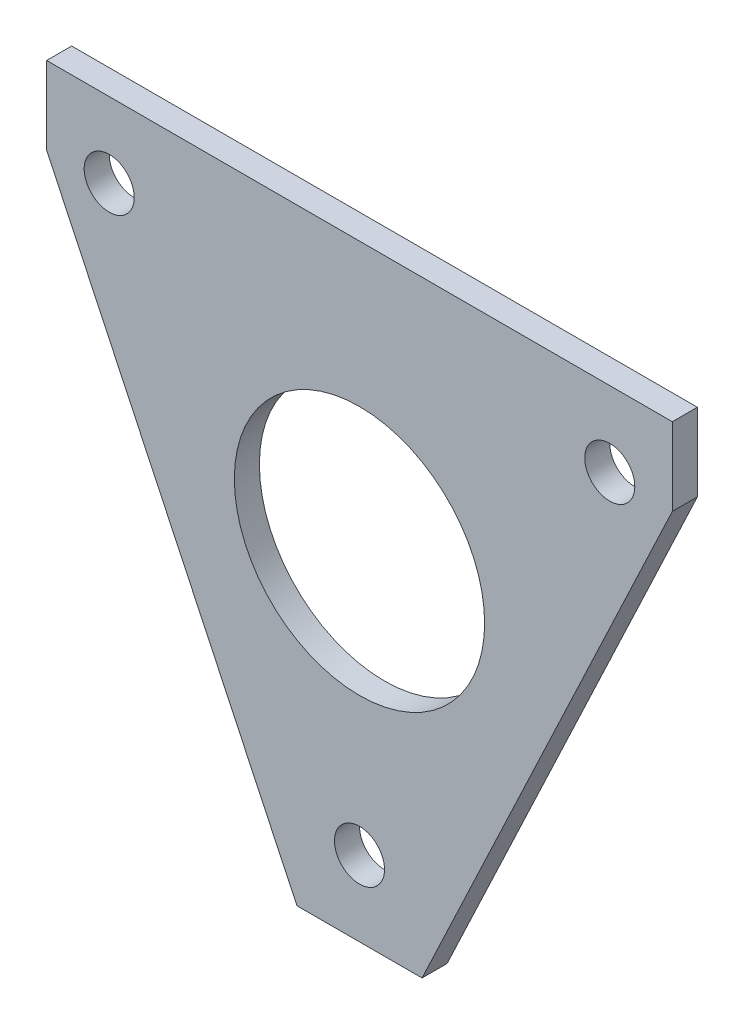
ISO-10303-21;
HEADER;
FILE_DESCRIPTION(('STEP AP214'),'2;1');
FILE_NAME('part.step','',(''),(''),'','','');
FILE_SCHEMA(('AUTOMOTIVE_DESIGN { 1 0 10303 214 1 1 1 1 }'));
ENDSEC;
DATA;
#1=APPLICATION_CONTEXT('core data for automotive mechanical design processes');
#2=APPLICATION_PROTOCOL_DEFINITION('international standard','automotive_design',2000,#1);
#3=PRODUCT_CONTEXT('',#1,'mechanical');
#4=PRODUCT('Part','Part','',(#3));
#5=PRODUCT_RELATED_PRODUCT_CATEGORY('part','',(#4));
#6=PRODUCT_DEFINITION_FORMATION('','',#4);
#7=PRODUCT_DEFINITION_CONTEXT('part definition',#1,'design');
#8=PRODUCT_DEFINITION('design','',#6,#7);
#9=PRODUCT_DEFINITION_SHAPE('','',#8);
#10=(LENGTH_UNIT() NAMED_UNIT(*) SI_UNIT(.MILLI.,.METRE.));
#11=(NAMED_UNIT(*) PLANE_ANGLE_UNIT() SI_UNIT($,.RADIAN.));
#12=(NAMED_UNIT(*) SI_UNIT($,.STERADIAN.) SOLID_ANGLE_UNIT());
#13=UNCERTAINTY_MEASURE_WITH_UNIT(LENGTH_MEASURE(1.E-05),#10,'distance_accuracy_value','');
#14=(GEOMETRIC_REPRESENTATION_CONTEXT(3) GLOBAL_UNCERTAINTY_ASSIGNED_CONTEXT((#13)) GLOBAL_UNIT_ASSIGNED_CONTEXT((#10,
#11,#12)) REPRESENTATION_CONTEXT('',''));
#15=CARTESIAN_POINT('',(0.,0.,0.));
#16=DIRECTION('',(0.,0.,1.));
#17=DIRECTION('',(1.,0.,0.));
#18=AXIS2_PLACEMENT_3D('',#15,#16,#17);
#19=CARTESIAN_POINT('',(0.,0.,4.));
#20=DIRECTION('',(0.,0.,1.));
#21=DIRECTION('',(1.,0.,0.));
#22=AXIS2_PLACEMENT_3D('',#19,#20,#21);
#23=PLANE('',#22);
#24=CARTESIAN_POINT('',(-21.4250045027839,-25.2125341603179,4.));
#25=DIRECTION('',(0.,0.,1.));
#26=DIRECTION('',(1.,0.,0.));
#27=AXIS2_PLACEMENT_3D('',#24,#25,#26);
#28=CIRCLE('',#27,20.);
#29=CARTESIAN_POINT('',(-1.4250045027839,-25.2125341603179,4.));
#30=VERTEX_POINT('',#29);
#31=EDGE_CURVE('E182',#30,#30,#28,.T.);
#32=ORIENTED_EDGE('',*,*,#31,.F.);
#33=EDGE_LOOP('',(#32));
#34=FACE_BOUND('',#33,.T.);
#35=CARTESIAN_POINT('',(18.5749954972161,5.68546583968215,4.));
#36=DIRECTION('',(0.,0.,1.));
#37=DIRECTION('',(1.,0.,0.));
#38=AXIS2_PLACEMENT_3D('',#35,#36,#37);
#39=CIRCLE('',#38,4.);
#40=CARTESIAN_POINT('',(22.5749954972161,5.68546583968215,4.));
#41=VERTEX_POINT('',#40);
#42=EDGE_CURVE('E194',#41,#41,#39,.T.);
#43=ORIENTED_EDGE('',*,*,#42,.F.);
#44=EDGE_LOOP('',(#43));
#45=FACE_BOUND('',#44,.T.);
#46=DIRECTION('',(0.,-1.,0.));
#47=VECTOR('',#46,1.);
#48=CARTESIAN_POINT('',(-71.4250045027839,17.6854658396821,4.));
#49=LINE('',#48,#47);
#50=CARTESIAN_POINT('',(-71.4250045027839,17.6854658396821,4.));
#51=VERTEX_POINT('',#50);
#52=CARTESIAN_POINT('',(-71.4250045027839,5.27207621951218,4.));
#53=VERTEX_POINT('',#52);
#54=EDGE_CURVE('E130',#51,#53,#49,.T.);
#55=ORIENTED_EDGE('',*,*,#54,.T.);
#56=DIRECTION('',(0.427498434771691,-0.904016088500506,0.));
#57=VECTOR('',#56,1.);
#58=CARTESIAN_POINT('',(-71.4250045027839,5.27207621951218,4.));
#59=LINE('',#58,#57);
#60=CARTESIAN_POINT('',(-31.4250045027839,-79.3145341603179,4.));
#61=VERTEX_POINT('',#60);
#62=EDGE_CURVE('E88',#53,#61,#59,.T.);
#63=ORIENTED_EDGE('',*,*,#62,.T.);
#64=DIRECTION('',(1.,0.,0.));
#65=VECTOR('',#64,1.);
#66=CARTESIAN_POINT('',(-31.4250045027839,-79.3145341603179,4.));
#67=LINE('',#66,#65);
#68=CARTESIAN_POINT('',(-11.4250045027839,-79.3145341603179,4.));
#69=VERTEX_POINT('',#68);
#70=EDGE_CURVE('E101',#61,#69,#67,.T.);
#71=ORIENTED_EDGE('',*,*,#70,.T.);
#72=DIRECTION('',(0.427498434771691,0.904016088500506,0.));
#73=VECTOR('',#72,1.);
#74=CARTESIAN_POINT('',(28.5749954972161,5.27207621951221,4.));
#75=LINE('',#74,#73);
#76=CARTESIAN_POINT('',(28.5749954972161,5.27207621951221,4.));
#77=VERTEX_POINT('',#76);
#78=EDGE_CURVE('E95',#69,#77,#75,.T.);
#79=ORIENTED_EDGE('',*,*,#78,.T.);
#80=DIRECTION('',(0.,1.,0.));
#81=VECTOR('',#80,1.);
#82=CARTESIAN_POINT('',(28.5749954972161,17.6854658396821,4.));
#83=LINE('',#82,#81);
#84=CARTESIAN_POINT('',(28.5749954972161,17.6854658396821,4.));
#85=VERTEX_POINT('',#84);
#86=EDGE_CURVE('E99',#77,#85,#83,.T.);
#87=ORIENTED_EDGE('',*,*,#86,.T.);
#88=DIRECTION('',(-1.,0.,0.));
#89=VECTOR('',#88,1.);
#90=CARTESIAN_POINT('',(-71.4250045027839,17.6854658396821,4.));
#91=LINE('',#90,#89);
#92=EDGE_CURVE('E51',#85,#51,#91,.T.);
#93=ORIENTED_EDGE('',*,*,#92,.T.);
#94=EDGE_LOOP('',(#55,#63,#71,#79,#87,#93));
#95=FACE_BOUND('',#94,.T.);
#96=CARTESIAN_POINT('',(-61.4250045027839,5.68546583968215,4.));
#97=DIRECTION('',(0.,0.,1.));
#98=DIRECTION('',(1.,0.,0.));
#99=AXIS2_PLACEMENT_3D('',#96,#97,#98);
#100=CIRCLE('',#99,4.00000000000001);
#101=CARTESIAN_POINT('',(-57.4250045027839,5.68546583968215,4.));
#102=VERTEX_POINT('',#101);
#103=EDGE_CURVE('E123',#102,#102,#100,.T.);
#104=ORIENTED_EDGE('',*,*,#103,.F.);
#105=EDGE_LOOP('',(#104));
#106=FACE_BOUND('',#105,.T.);
#107=CARTESIAN_POINT('',(-21.4250045027839,-67.3145341603179,4.));
#108=DIRECTION('',(0.,0.,1.));
#109=DIRECTION('',(1.,0.,0.));
#110=AXIS2_PLACEMENT_3D('',#107,#108,#109);
#111=CIRCLE('',#110,4.);
#112=CARTESIAN_POINT('',(-17.4250045027839,-67.3145341603179,4.));
#113=VERTEX_POINT('',#112);
#114=EDGE_CURVE('E187',#113,#113,#111,.T.);
#115=ORIENTED_EDGE('',*,*,#114,.F.);
#116=EDGE_LOOP('',(#115));
#117=FACE_BOUND('',#116,.T.);
#118=ADVANCED_FACE('F33',(#34,#45,#95,#106,#117),#23,.T.);
#119=CARTESIAN_POINT('',(0.,0.,0.));
#120=DIRECTION('',(0.,0.,1.));
#121=DIRECTION('',(1.,0.,0.));
#122=AXIS2_PLACEMENT_3D('',#119,#120,#121);
#123=PLANE('',#122);
#124=CARTESIAN_POINT('',(-21.4250045027839,-25.2125341603179,0.));
#125=DIRECTION('',(0.,0.,1.));
#126=DIRECTION('',(1.,0.,0.));
#127=AXIS2_PLACEMENT_3D('',#124,#125,#126);
#128=CIRCLE('',#127,20.);
#129=CARTESIAN_POINT('',(-1.4250045027839,-25.2125341603179,0.));
#130=VERTEX_POINT('',#129);
#131=EDGE_CURVE('E37',#130,#130,#128,.T.);
#132=ORIENTED_EDGE('',*,*,#131,.T.);
#133=EDGE_LOOP('',(#132));
#134=FACE_BOUND('',#133,.T.);
#135=CARTESIAN_POINT('',(18.5749954972161,5.68546583968215,0.));
#136=DIRECTION('',(0.,0.,1.));
#137=DIRECTION('',(1.,0.,0.));
#138=AXIS2_PLACEMENT_3D('',#135,#136,#137);
#139=CIRCLE('',#138,4.);
#140=CARTESIAN_POINT('',(22.5749954972161,5.68546583968215,0.));
#141=VERTEX_POINT('',#140);
#142=EDGE_CURVE('E192',#141,#141,#139,.T.);
#143=ORIENTED_EDGE('',*,*,#142,.T.);
#144=EDGE_LOOP('',(#143));
#145=FACE_BOUND('',#144,.T.);
#146=DIRECTION('',(0.,-1.,0.));
#147=VECTOR('',#146,1.);
#148=CARTESIAN_POINT('',(-71.4250045027839,17.6854658396821,0.));
#149=LINE('',#148,#147);
#150=CARTESIAN_POINT('',(-71.4250045027839,17.6854658396821,0.));
#151=VERTEX_POINT('',#150);
#152=CARTESIAN_POINT('',(-71.4250045027839,5.27207621951218,0.));
#153=VERTEX_POINT('',#152);
#154=EDGE_CURVE('E119',#151,#153,#149,.T.);
#155=ORIENTED_EDGE('',*,*,#154,.F.);
#156=DIRECTION('',(-1.,0.,0.));
#157=VECTOR('',#156,1.);
#158=CARTESIAN_POINT('',(-71.4250045027839,17.6854658396821,0.));
#159=LINE('',#158,#157);
#160=CARTESIAN_POINT('',(28.5749954972161,17.6854658396821,0.));
#161=VERTEX_POINT('',#160);
#162=EDGE_CURVE('E80',#161,#151,#159,.T.);
#163=ORIENTED_EDGE('',*,*,#162,.F.);
#164=DIRECTION('',(0.,1.,0.));
#165=VECTOR('',#164,1.);
#166=CARTESIAN_POINT('',(28.5749954972161,17.6854658396821,0.));
#167=LINE('',#166,#165);
#168=CARTESIAN_POINT('',(28.5749954972161,5.27207621951221,0.));
#169=VERTEX_POINT('',#168);
#170=EDGE_CURVE('E74',#169,#161,#167,.T.);
#171=ORIENTED_EDGE('',*,*,#170,.F.);
#172=DIRECTION('',(0.427498434771691,0.904016088500506,0.));
#173=VECTOR('',#172,1.);
#174=CARTESIAN_POINT('',(28.5749954972161,5.27207621951221,0.));
#175=LINE('',#174,#173);
#176=CARTESIAN_POINT('',(-11.4250045027839,-79.3145341603179,0.));
#177=VERTEX_POINT('',#176);
#178=EDGE_CURVE('E109',#177,#169,#175,.T.);
#179=ORIENTED_EDGE('',*,*,#178,.F.);
#180=DIRECTION('',(1.,0.,0.));
#181=VECTOR('',#180,1.);
#182=CARTESIAN_POINT('',(-31.4250045027839,-79.3145341603179,0.));
#183=LINE('',#182,#181);
#184=CARTESIAN_POINT('',(-31.4250045027839,-79.3145341603179,0.));
#185=VERTEX_POINT('',#184);
#186=EDGE_CURVE('E125',#185,#177,#183,.T.);
#187=ORIENTED_EDGE('',*,*,#186,.F.);
#188=DIRECTION('',(0.427498434771691,-0.904016088500506,0.));
#189=VECTOR('',#188,1.);
#190=CARTESIAN_POINT('',(-71.4250045027839,5.27207621951218,0.));
#191=LINE('',#190,#189);
#192=EDGE_CURVE('E122',#153,#185,#191,.T.);
#193=ORIENTED_EDGE('',*,*,#192,.F.);
#194=EDGE_LOOP('',(#155,#163,#171,#179,#187,#193));
#195=FACE_BOUND('',#194,.T.);
#196=CARTESIAN_POINT('',(-61.4250045027839,5.68546583968215,0.));
#197=DIRECTION('',(0.,0.,1.));
#198=DIRECTION('',(1.,0.,0.));
#199=AXIS2_PLACEMENT_3D('',#196,#197,#198);
#200=CIRCLE('',#199,4.00000000000001);
#201=CARTESIAN_POINT('',(-57.4250045027839,5.68546583968215,0.));
#202=VERTEX_POINT('',#201);
#203=EDGE_CURVE('E197',#202,#202,#200,.T.);
#204=ORIENTED_EDGE('',*,*,#203,.T.);
#205=EDGE_LOOP('',(#204));
#206=FACE_BOUND('',#205,.T.);
#207=CARTESIAN_POINT('',(-21.4250045027839,-67.3145341603179,0.));
#208=DIRECTION('',(0.,0.,1.));
#209=DIRECTION('',(1.,0.,0.));
#210=AXIS2_PLACEMENT_3D('',#207,#208,#209);
#211=CIRCLE('',#210,4.);
#212=CARTESIAN_POINT('',(-17.4250045027839,-67.3145341603179,0.));
#213=VERTEX_POINT('',#212);
#214=EDGE_CURVE('E185',#213,#213,#211,.T.);
#215=ORIENTED_EDGE('',*,*,#214,.T.);
#216=EDGE_LOOP('',(#215));
#217=FACE_BOUND('',#216,.T.);
#218=ADVANCED_FACE('F140',(#134,#145,#195,#206,#217),#123,.F.);
#219=CARTESIAN_POINT('',(-71.4250045027839,17.6854658396821,4.));
#220=DIRECTION('',(1.,0.,0.));
#221=DIRECTION('',(0.,1.,0.));
#222=AXIS2_PLACEMENT_3D('',#219,#220,#221);
#223=PLANE('',#222);
#224=ORIENTED_EDGE('',*,*,#154,.T.);
#225=DIRECTION('',(0.,0.,-1.));
#226=VECTOR('',#225,1.);
#227=CARTESIAN_POINT('',(-71.4250045027839,5.27207621951218,4.));
#228=LINE('',#227,#226);
#229=EDGE_CURVE('E11',#53,#153,#228,.T.);
#230=ORIENTED_EDGE('',*,*,#229,.F.);
#231=ORIENTED_EDGE('',*,*,#54,.F.);
#232=DIRECTION('',(0.,0.,-1.));
#233=VECTOR('',#232,1.);
#234=CARTESIAN_POINT('',(-71.4250045027839,17.6854658396821,4.));
#235=LINE('',#234,#233);
#236=EDGE_CURVE('E115',#51,#151,#235,.T.);
#237=ORIENTED_EDGE('',*,*,#236,.T.);
#238=EDGE_LOOP('',(#224,#230,#231,#237));
#239=FACE_BOUND('',#238,.T.);
#240=ADVANCED_FACE('F35',(#239),#223,.F.);
#241=CARTESIAN_POINT('',(-71.4250045027839,5.27207621951218,4.));
#242=DIRECTION('',(0.904016088500506,0.427498434771691,0.));
#243=DIRECTION('',(-0.427498434771691,0.904016088500506,0.));
#244=AXIS2_PLACEMENT_3D('',#241,#242,#243);
#245=PLANE('',#244);
#246=ORIENTED_EDGE('',*,*,#192,.T.);
#247=DIRECTION('',(0.,0.,-1.));
#248=VECTOR('',#247,1.);
#249=CARTESIAN_POINT('',(-31.4250045027839,-79.3145341603179,4.));
#250=LINE('',#249,#248);
#251=EDGE_CURVE('E43',#61,#185,#250,.T.);
#252=ORIENTED_EDGE('',*,*,#251,.F.);
#253=ORIENTED_EDGE('',*,*,#62,.F.);
#254=ORIENTED_EDGE('',*,*,#229,.T.);
#255=EDGE_LOOP('',(#246,#252,#253,#254));
#256=FACE_BOUND('',#255,.T.);
#257=ADVANCED_FACE('F257',(#256),#245,.F.);
#258=CARTESIAN_POINT('',(-31.4250045027839,-79.3145341603179,4.));
#259=DIRECTION('',(0.,1.,0.));
#260=DIRECTION('',(0.,0.,1.));
#261=AXIS2_PLACEMENT_3D('',#258,#259,#260);
#262=PLANE('',#261);
#263=ORIENTED_EDGE('',*,*,#186,.T.);
#264=DIRECTION('',(0.,0.,-1.));
#265=VECTOR('',#264,1.);
#266=CARTESIAN_POINT('',(-11.4250045027839,-79.3145341603179,4.));
#267=LINE('',#266,#265);
#268=EDGE_CURVE('E110',#69,#177,#267,.T.);
#269=ORIENTED_EDGE('',*,*,#268,.F.);
#270=ORIENTED_EDGE('',*,*,#70,.F.);
#271=ORIENTED_EDGE('',*,*,#251,.T.);
#272=EDGE_LOOP('',(#263,#269,#270,#271));
#273=FACE_BOUND('',#272,.T.);
#274=ADVANCED_FACE('F137',(#273),#262,.F.);
#275=CARTESIAN_POINT('',(28.5749954972161,5.27207621951221,4.));
#276=DIRECTION('',(-0.904016088500506,0.427498434771691,0.));
#277=DIRECTION('',(-0.427498434771691,-0.904016088500506,0.));
#278=AXIS2_PLACEMENT_3D('',#275,#276,#277);
#279=PLANE('',#278);
#280=ORIENTED_EDGE('',*,*,#178,.T.);
#281=DIRECTION('',(0.,0.,-1.));
#282=VECTOR('',#281,1.);
#283=CARTESIAN_POINT('',(28.5749954972161,5.27207621951221,4.));
#284=LINE('',#283,#282);
#285=EDGE_CURVE('E106',#77,#169,#284,.T.);
#286=ORIENTED_EDGE('',*,*,#285,.F.);
#287=ORIENTED_EDGE('',*,*,#78,.F.);
#288=ORIENTED_EDGE('',*,*,#268,.T.);
#289=EDGE_LOOP('',(#280,#286,#287,#288));
#290=FACE_BOUND('',#289,.T.);
#291=ADVANCED_FACE('F107',(#290),#279,.F.);
#292=CARTESIAN_POINT('',(28.5749954972161,17.6854658396821,4.));
#293=DIRECTION('',(-1.,0.,0.));
#294=DIRECTION('',(0.,-1.,0.));
#295=AXIS2_PLACEMENT_3D('',#292,#293,#294);
#296=PLANE('',#295);
#297=ORIENTED_EDGE('',*,*,#170,.T.);
#298=DIRECTION('',(0.,0.,-1.));
#299=VECTOR('',#298,1.);
#300=CARTESIAN_POINT('',(28.5749954972161,17.6854658396821,4.));
#301=LINE('',#300,#299);
#302=EDGE_CURVE('E111',#85,#161,#301,.T.);
#303=ORIENTED_EDGE('',*,*,#302,.F.);
#304=ORIENTED_EDGE('',*,*,#86,.F.);
#305=ORIENTED_EDGE('',*,*,#285,.T.);
#306=EDGE_LOOP('',(#297,#303,#304,#305));
#307=FACE_BOUND('',#306,.T.);
#308=ADVANCED_FACE('F113',(#307),#296,.F.);
#309=CARTESIAN_POINT('',(-71.4250045027839,17.6854658396821,4.));
#310=DIRECTION('',(0.,-1.,0.));
#311=DIRECTION('',(0.,0.,-1.));
#312=AXIS2_PLACEMENT_3D('',#309,#310,#311);
#313=PLANE('',#312);
#314=ORIENTED_EDGE('',*,*,#162,.T.);
#315=ORIENTED_EDGE('',*,*,#236,.F.);
#316=ORIENTED_EDGE('',*,*,#92,.F.);
#317=ORIENTED_EDGE('',*,*,#302,.T.);
#318=EDGE_LOOP('',(#314,#315,#316,#317));
#319=FACE_BOUND('',#318,.T.);
#320=ADVANCED_FACE('F145',(#319),#313,.F.);
#321=CARTESIAN_POINT('',(-61.4250045027839,5.68546583968215,4.));
#322=DIRECTION('',(0.,0.,-1.));
#323=DIRECTION('',(-1.,0.,0.));
#324=AXIS2_PLACEMENT_3D('',#321,#322,#323);
#325=CYLINDRICAL_SURFACE('',#324,4.00000000000001);
#326=ORIENTED_EDGE('',*,*,#103,.T.);
#327=EDGE_LOOP('',(#326));
#328=FACE_BOUND('',#327,.T.);
#329=ORIENTED_EDGE('',*,*,#203,.F.);
#330=EDGE_LOOP('',(#329));
#331=FACE_BOUND('',#330,.T.);
#332=ADVANCED_FACE('F147',(#328,#331),#325,.F.);
#333=CARTESIAN_POINT('',(18.5749954972161,5.68546583968215,4.));
#334=DIRECTION('',(0.,0.,-1.));
#335=DIRECTION('',(-1.,0.,0.));
#336=AXIS2_PLACEMENT_3D('',#333,#334,#335);
#337=CYLINDRICAL_SURFACE('',#336,4.);
#338=ORIENTED_EDGE('',*,*,#42,.T.);
#339=EDGE_LOOP('',(#338));
#340=FACE_BOUND('',#339,.T.);
#341=ORIENTED_EDGE('',*,*,#142,.F.);
#342=EDGE_LOOP('',(#341));
#343=FACE_BOUND('',#342,.T.);
#344=ADVANCED_FACE('F153',(#340,#343),#337,.F.);
#345=CARTESIAN_POINT('',(-21.4250045027839,-67.3145341603179,4.));
#346=DIRECTION('',(0.,0.,-1.));
#347=DIRECTION('',(-1.,0.,0.));
#348=AXIS2_PLACEMENT_3D('',#345,#346,#347);
#349=CYLINDRICAL_SURFACE('',#348,4.);
#350=ORIENTED_EDGE('',*,*,#114,.T.);
#351=EDGE_LOOP('',(#350));
#352=FACE_BOUND('',#351,.T.);
#353=ORIENTED_EDGE('',*,*,#214,.F.);
#354=EDGE_LOOP('',(#353));
#355=FACE_BOUND('',#354,.T.);
#356=ADVANCED_FACE('F170',(#352,#355),#349,.F.);
#357=CARTESIAN_POINT('',(-21.4250045027839,-25.2125341603179,-6.));
#358=DIRECTION('',(0.,0.,1.));
#359=DIRECTION('',(1.,0.,0.));
#360=AXIS2_PLACEMENT_3D('',#357,#358,#359);
#361=CYLINDRICAL_SURFACE('',#360,20.);
#362=ORIENTED_EDGE('',*,*,#31,.T.);
#363=EDGE_LOOP('',(#362));
#364=FACE_BOUND('',#363,.T.);
#365=ORIENTED_EDGE('',*,*,#131,.F.);
#366=EDGE_LOOP('',(#365));
#367=FACE_BOUND('',#366,.T.);
#368=ADVANCED_FACE('F174',(#364,#367),#361,.F.);
#369=CLOSED_SHELL('',(#118,#218,#240,#257,#274,#291,#308,#320,#332,#344,#356,#368));
#370=MANIFOLD_SOLID_BREP('B2',#369);
#371=ADVANCED_BREP_SHAPE_REPRESENTATION('',(#18,#370),#14);
#372=SHAPE_DEFINITION_REPRESENTATION(#9,#371);
ENDSEC;
END-ISO-10303-21;
